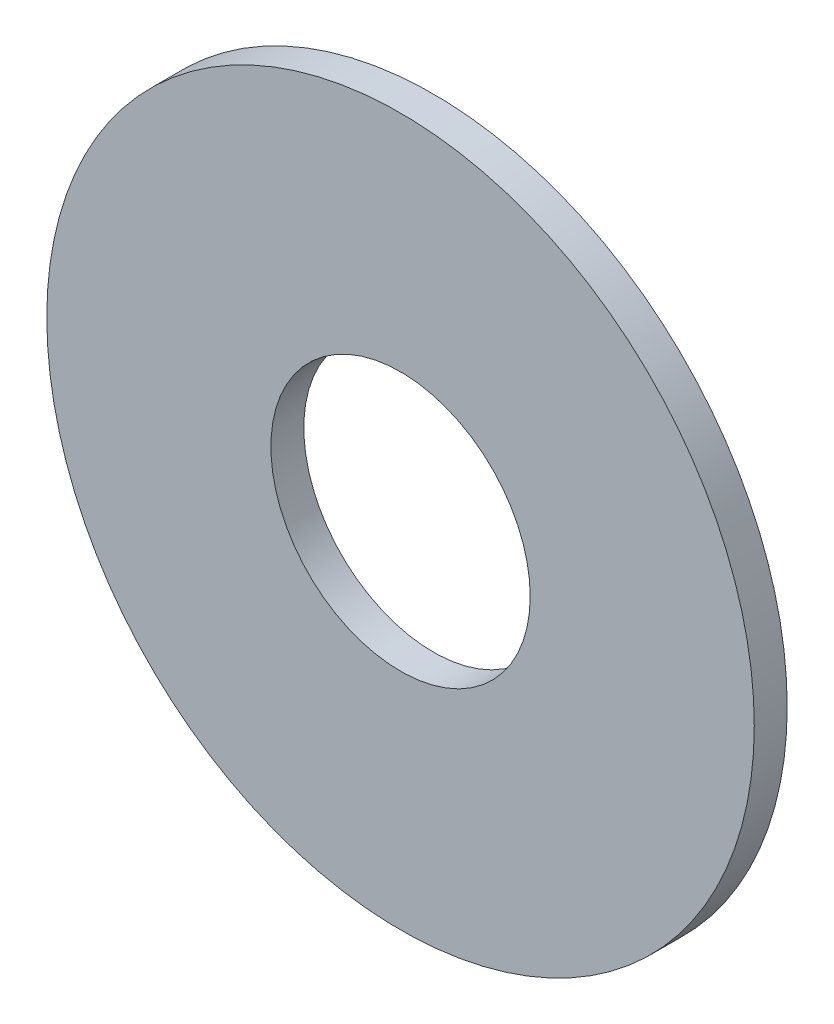
ISO-10303-21;
HEADER;
FILE_DESCRIPTION(('STEP AP214'),'2;1');
FILE_NAME('part.step','',(''),(''),'','','');
FILE_SCHEMA(('AUTOMOTIVE_DESIGN { 1 0 10303 214 1 1 1 1 }'));
ENDSEC;
DATA;
#1=APPLICATION_CONTEXT('core data for automotive mechanical design processes');
#2=APPLICATION_PROTOCOL_DEFINITION('international standard','automotive_design',2000,#1);
#3=PRODUCT_CONTEXT('',#1,'mechanical');
#4=PRODUCT('Part','Part','',(#3));
#5=PRODUCT_RELATED_PRODUCT_CATEGORY('part','',(#4));
#6=PRODUCT_DEFINITION_FORMATION('','',#4);
#7=PRODUCT_DEFINITION_CONTEXT('part definition',#1,'design');
#8=PRODUCT_DEFINITION('design','',#6,#7);
#9=PRODUCT_DEFINITION_SHAPE('','',#8);
#10=(LENGTH_UNIT() NAMED_UNIT(*) SI_UNIT(.MILLI.,.METRE.));
#11=(NAMED_UNIT(*) PLANE_ANGLE_UNIT() SI_UNIT($,.RADIAN.));
#12=(NAMED_UNIT(*) SI_UNIT($,.STERADIAN.) SOLID_ANGLE_UNIT());
#13=UNCERTAINTY_MEASURE_WITH_UNIT(LENGTH_MEASURE(1.E-05),#10,'distance_accuracy_value','');
#14=(GEOMETRIC_REPRESENTATION_CONTEXT(3) GLOBAL_UNCERTAINTY_ASSIGNED_CONTEXT((#13)) GLOBAL_UNIT_ASSIGNED_CONTEXT((#10,
#11,#12)) REPRESENTATION_CONTEXT('',''));
#15=CARTESIAN_POINT('',(0.,0.,0.));
#16=DIRECTION('',(0.,0.,1.));
#17=DIRECTION('',(1.,0.,0.));
#18=AXIS2_PLACEMENT_3D('',#15,#16,#17);
#19=CARTESIAN_POINT('',(0.,0.,-0.406399999999995));
#20=DIRECTION('',(0.,0.,1.));
#21=DIRECTION('',(1.,0.,0.));
#22=AXIS2_PLACEMENT_3D('',#19,#20,#21);
#23=CYLINDRICAL_SURFACE('',#22,8.73125);
#24=CARTESIAN_POINT('',(0.,0.,-0.406399999999995));
#25=DIRECTION('',(0.,0.,1.));
#26=DIRECTION('',(1.,0.,0.));
#27=AXIS2_PLACEMENT_3D('',#24,#25,#26);
#28=CIRCLE('',#27,8.73125);
#29=CARTESIAN_POINT('',(8.73125,0.,-0.406399999999995));
#30=VERTEX_POINT('',#29);
#31=EDGE_CURVE('E10',#30,#30,#28,.T.);
#32=ORIENTED_EDGE('',*,*,#31,.T.);
#33=EDGE_LOOP('',(#32));
#34=FACE_BOUND('',#33,.T.);
#35=CARTESIAN_POINT('',(0.,0.,0.406400000000005));
#36=DIRECTION('',(0.,0.,1.));
#37=DIRECTION('',(1.,0.,0.));
#38=AXIS2_PLACEMENT_3D('',#35,#36,#37);
#39=CIRCLE('',#38,8.73125);
#40=CARTESIAN_POINT('',(8.73125,0.,0.406400000000005));
#41=VERTEX_POINT('',#40);
#42=EDGE_CURVE('E40',#41,#41,#39,.T.);
#43=ORIENTED_EDGE('',*,*,#42,.F.);
#44=EDGE_LOOP('',(#43));
#45=FACE_BOUND('',#44,.T.);
#46=ADVANCED_FACE('F30',(#34,#45),#23,.T.);
#47=CARTESIAN_POINT('',(0.,0.,-0.406399999999995));
#48=DIRECTION('',(0.,0.,1.));
#49=DIRECTION('',(1.,0.,0.));
#50=AXIS2_PLACEMENT_3D('',#47,#48,#49);
#51=PLANE('',#50);
#52=CARTESIAN_POINT('',(0.,0.,-0.406399999999995));
#53=DIRECTION('',(0.,0.,1.));
#54=DIRECTION('',(1.,0.,0.));
#55=AXIS2_PLACEMENT_3D('',#52,#53,#54);
#56=CIRCLE('',#55,3.2004);
#57=CARTESIAN_POINT('',(3.2004,0.,-0.406399999999995));
#58=VERTEX_POINT('',#57);
#59=EDGE_CURVE('E36',#58,#58,#56,.T.);
#60=ORIENTED_EDGE('',*,*,#59,.T.);
#61=EDGE_LOOP('',(#60));
#62=FACE_BOUND('',#61,.T.);
#63=ORIENTED_EDGE('',*,*,#31,.F.);
#64=EDGE_LOOP('',(#63));
#65=FACE_BOUND('',#64,.T.);
#66=ADVANCED_FACE('F59',(#62,#65),#51,.F.);
#67=CARTESIAN_POINT('',(0.,0.,-0.406399999999995));
#68=DIRECTION('',(0.,0.,1.));
#69=DIRECTION('',(1.,0.,0.));
#70=AXIS2_PLACEMENT_3D('',#67,#68,#69);
#71=CYLINDRICAL_SURFACE('',#70,3.2004);
#72=ORIENTED_EDGE('',*,*,#59,.F.);
#73=EDGE_LOOP('',(#72));
#74=FACE_BOUND('',#73,.T.);
#75=CARTESIAN_POINT('',(0.,0.,0.406400000000005));
#76=DIRECTION('',(0.,0.,1.));
#77=DIRECTION('',(1.,0.,0.));
#78=AXIS2_PLACEMENT_3D('',#75,#76,#77);
#79=CIRCLE('',#78,3.2004);
#80=CARTESIAN_POINT('',(3.2004,0.,0.406400000000005));
#81=VERTEX_POINT('',#80);
#82=EDGE_CURVE('E44',#81,#81,#79,.T.);
#83=ORIENTED_EDGE('',*,*,#82,.T.);
#84=EDGE_LOOP('',(#83));
#85=FACE_BOUND('',#84,.T.);
#86=ADVANCED_FACE('F50',(#74,#85),#71,.F.);
#87=CARTESIAN_POINT('',(0.,0.,0.406400000000005));
#88=DIRECTION('',(0.,0.,1.));
#89=DIRECTION('',(1.,0.,0.));
#90=AXIS2_PLACEMENT_3D('',#87,#88,#89);
#91=PLANE('',#90);
#92=ORIENTED_EDGE('',*,*,#42,.T.);
#93=EDGE_LOOP('',(#92));
#94=FACE_BOUND('',#93,.T.);
#95=ORIENTED_EDGE('',*,*,#82,.F.);
#96=EDGE_LOOP('',(#95));
#97=FACE_BOUND('',#96,.T.);
#98=ADVANCED_FACE('F52',(#94,#97),#91,.T.);
#99=CLOSED_SHELL('',(#46,#66,#86,#98));
#100=MANIFOLD_SOLID_BREP('B2',#99);
#101=ADVANCED_BREP_SHAPE_REPRESENTATION('',(#18,#100),#14);
#102=SHAPE_DEFINITION_REPRESENTATION(#9,#101);
ENDSEC;
END-ISO-10303-21;
